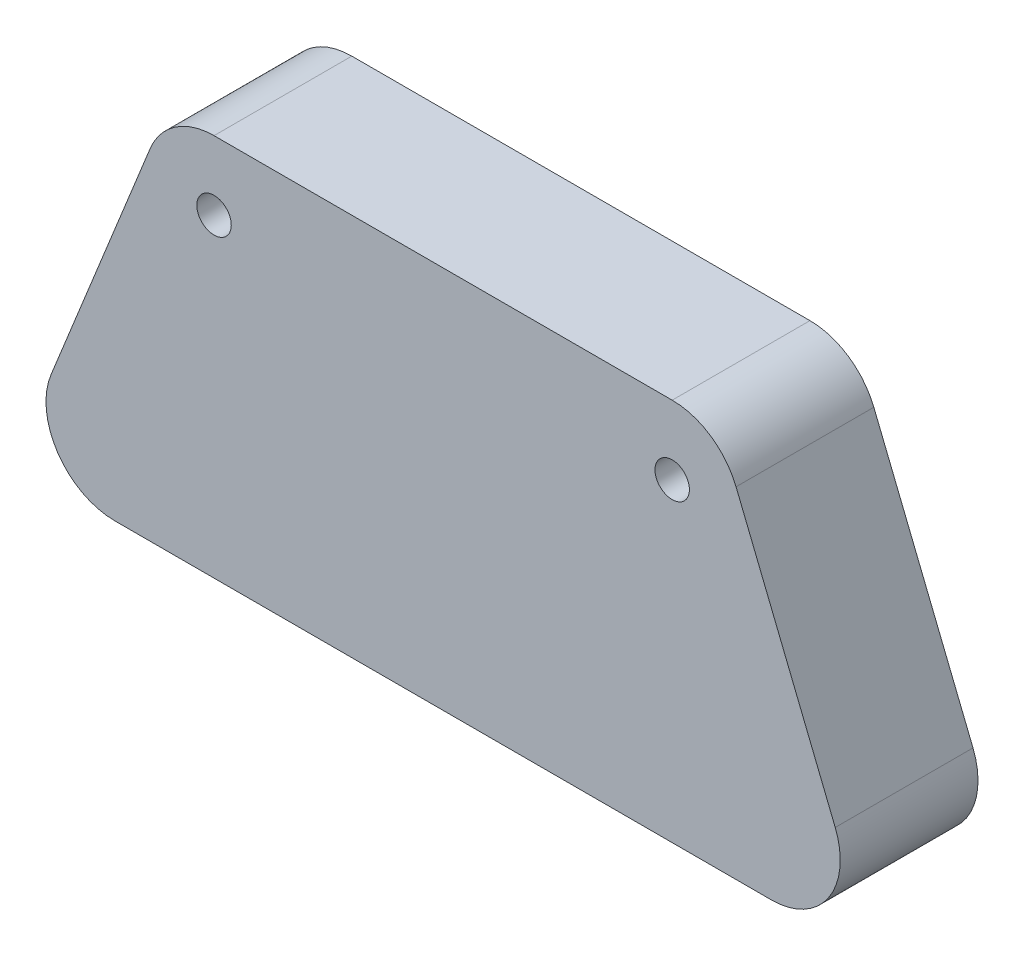
ISO-10303-21;
HEADER;
FILE_DESCRIPTION(('STEP AP214'),'2;1');
FILE_NAME('part.step','',(''),(''),'','','');
FILE_SCHEMA(('AUTOMOTIVE_DESIGN { 1 0 10303 214 1 1 1 1 }'));
ENDSEC;
DATA;
#1=APPLICATION_CONTEXT('core data for automotive mechanical design processes');
#2=APPLICATION_PROTOCOL_DEFINITION('international standard','automotive_design',2000,#1);
#3=PRODUCT_CONTEXT('',#1,'mechanical');
#4=PRODUCT('Part','Part','',(#3));
#5=PRODUCT_RELATED_PRODUCT_CATEGORY('part','',(#4));
#6=PRODUCT_DEFINITION_FORMATION('','',#4);
#7=PRODUCT_DEFINITION_CONTEXT('part definition',#1,'design');
#8=PRODUCT_DEFINITION('design','',#6,#7);
#9=PRODUCT_DEFINITION_SHAPE('','',#8);
#10=(LENGTH_UNIT() NAMED_UNIT(*) SI_UNIT(.MILLI.,.METRE.));
#11=(NAMED_UNIT(*) PLANE_ANGLE_UNIT() SI_UNIT($,.RADIAN.));
#12=(NAMED_UNIT(*) SI_UNIT($,.STERADIAN.) SOLID_ANGLE_UNIT());
#13=UNCERTAINTY_MEASURE_WITH_UNIT(LENGTH_MEASURE(1.E-05),#10,'distance_accuracy_value','');
#14=(GEOMETRIC_REPRESENTATION_CONTEXT(3) GLOBAL_UNCERTAINTY_ASSIGNED_CONTEXT((#13)) GLOBAL_UNIT_ASSIGNED_CONTEXT((#10,
#11,#12)) REPRESENTATION_CONTEXT('',''));
#15=CARTESIAN_POINT('',(0.,0.,0.));
#16=DIRECTION('',(0.,0.,1.));
#17=DIRECTION('',(1.,0.,0.));
#18=AXIS2_PLACEMENT_3D('',#15,#16,#17);
#19=CARTESIAN_POINT('',(-16.0060225330843,-10.1946223443207,10.));
#20=DIRECTION('',(0.,0.,1.));
#21=DIRECTION('',(1.,0.,0.));
#22=AXIS2_PLACEMENT_3D('',#19,#20,#21);
#23=PLANE('',#22);
#24=CARTESIAN_POINT('',(-8.80808698895859,7.62089329268293,10.));
#25=DIRECTION('',(0.,0.,1.));
#26=DIRECTION('',(1.,0.,0.));
#27=AXIS2_PLACEMENT_3D('',#24,#25,#26);
#28=CIRCLE('',#27,1.25);
#29=CARTESIAN_POINT('',(-7.55808698895859,7.62089329268293,10.));
#30=VERTEX_POINT('',#29);
#31=EDGE_CURVE('E133',#30,#30,#28,.T.);
#32=ORIENTED_EDGE('',*,*,#31,.F.);
#33=EDGE_LOOP('',(#32));
#34=FACE_BOUND('',#33,.T.);
#35=CARTESIAN_POINT('',(-16.0060225330843,-10.1946223443207,10.));
#36=DIRECTION('',(0.,0.,1.));
#37=DIRECTION('',(1.,0.,0.));
#38=AXIS2_PLACEMENT_3D('',#35,#36,#37);
#39=CIRCLE('',#38,5.);
#40=CARTESIAN_POINT('',(-20.6419418059183,-8.32158937724111,10.));
#41=VERTEX_POINT('',#40);
#42=CARTESIAN_POINT('',(-16.0060225330843,-15.1946223443207,10.));
#43=VERTEX_POINT('',#42);
#44=EDGE_CURVE('E144',#41,#43,#39,.T.);
#45=ORIENTED_EDGE('',*,*,#44,.T.);
#46=DIRECTION('',(1.,0.,0.));
#47=VECTOR('',#46,1.);
#48=CARTESIAN_POINT('',(-16.0060225330843,-15.1946223443207,10.));
#49=LINE('',#48,#47);
#50=CARTESIAN_POINT('',(31.6447633867428,-15.1946223443207,10.));
#51=VERTEX_POINT('',#50);
#52=EDGE_CURVE('E92',#43,#51,#49,.T.);
#53=ORIENTED_EDGE('',*,*,#52,.T.);
#54=CARTESIAN_POINT('',(31.6447633867429,-10.1946223443207,10.));
#55=DIRECTION('',(0.,0.,1.));
#56=DIRECTION('',(-1.,0.,0.));
#57=AXIS2_PLACEMENT_3D('',#54,#55,#56);
#58=CIRCLE('',#57,5.);
#59=CARTESIAN_POINT('',(36.2806826595768,-8.32158937724112,10.));
#60=VERTEX_POINT('',#59);
#61=EDGE_CURVE('E159',#51,#60,#58,.T.);
#62=ORIENTED_EDGE('',*,*,#61,.T.);
#63=DIRECTION('',(-0.37460659341591,0.927183854566788,0.));
#64=VECTOR('',#63,1.);
#65=CARTESIAN_POINT('',(29.0827471154511,9.49392625976246,10.));
#66=LINE('',#65,#64);
#67=CARTESIAN_POINT('',(29.0827471154511,9.49392625976246,10.));
#68=VERTEX_POINT('',#67);
#69=EDGE_CURVE('E172',#60,#68,#66,.T.);
#70=ORIENTED_EDGE('',*,*,#69,.T.);
#71=CARTESIAN_POINT('',(24.4468278426171,7.62089329268293,10.));
#72=DIRECTION('',(0.,0.,1.));
#73=DIRECTION('',(-1.,0.,0.));
#74=AXIS2_PLACEMENT_3D('',#71,#72,#73);
#75=CIRCLE('',#74,5.);
#76=CARTESIAN_POINT('',(24.4468278426171,12.6208932926829,10.));
#77=VERTEX_POINT('',#76);
#78=EDGE_CURVE('E111',#68,#77,#75,.T.);
#79=ORIENTED_EDGE('',*,*,#78,.T.);
#80=DIRECTION('',(-1.,0.,0.));
#81=VECTOR('',#80,1.);
#82=CARTESIAN_POINT('',(-8.80808698895856,12.6208932926829,10.));
#83=LINE('',#82,#81);
#84=CARTESIAN_POINT('',(-8.80808698895856,12.6208932926829,10.));
#85=VERTEX_POINT('',#84);
#86=EDGE_CURVE('E105',#77,#85,#83,.T.);
#87=ORIENTED_EDGE('',*,*,#86,.T.);
#88=CARTESIAN_POINT('',(-8.80808698895859,7.62089329268293,10.));
#89=DIRECTION('',(0.,0.,1.));
#90=DIRECTION('',(1.,0.,0.));
#91=AXIS2_PLACEMENT_3D('',#88,#89,#90);
#92=CIRCLE('',#91,5.);
#93=CARTESIAN_POINT('',(-13.4440062617925,9.49392625976245,10.));
#94=VERTEX_POINT('',#93);
#95=EDGE_CURVE('E109',#85,#94,#92,.T.);
#96=ORIENTED_EDGE('',*,*,#95,.T.);
#97=DIRECTION('',(-0.37460659341591,-0.927183854566789,0.));
#98=VECTOR('',#97,1.);
#99=CARTESIAN_POINT('',(-13.4440062617925,9.49392625976245,10.));
#100=LINE('',#99,#98);
#101=EDGE_CURVE('E49',#94,#41,#100,.T.);
#102=ORIENTED_EDGE('',*,*,#101,.T.);
#103=EDGE_LOOP('',(#45,#53,#62,#70,#79,#87,#96,#102));
#104=FACE_BOUND('',#103,.T.);
#105=CARTESIAN_POINT('',(24.4468278426171,7.62089329268293,10.));
#106=DIRECTION('',(0.,0.,1.));
#107=DIRECTION('',(1.,0.,0.));
#108=AXIS2_PLACEMENT_3D('',#105,#106,#107);
#109=CIRCLE('',#108,1.25);
#110=CARTESIAN_POINT('',(25.6968278426171,7.62089329268293,10.));
#111=VERTEX_POINT('',#110);
#112=EDGE_CURVE('E181',#111,#111,#109,.T.);
#113=ORIENTED_EDGE('',*,*,#112,.F.);
#114=EDGE_LOOP('',(#113));
#115=FACE_BOUND('',#114,.T.);
#116=ADVANCED_FACE('F32',(#34,#104,#115),#23,.T.);
#117=CARTESIAN_POINT('',(-16.0060225330843,-10.1946223443207,0.));
#118=DIRECTION('',(0.,0.,1.));
#119=DIRECTION('',(1.,0.,0.));
#120=AXIS2_PLACEMENT_3D('',#117,#118,#119);
#121=PLANE('',#120);
#122=CARTESIAN_POINT('',(-8.80808698895859,7.62089329268293,0.));
#123=DIRECTION('',(0.,0.,1.));
#124=DIRECTION('',(1.,0.,0.));
#125=AXIS2_PLACEMENT_3D('',#122,#123,#124);
#126=CIRCLE('',#125,1.25);
#127=CARTESIAN_POINT('',(-7.55808698895859,7.62089329268293,0.));
#128=VERTEX_POINT('',#127);
#129=EDGE_CURVE('E178',#128,#128,#126,.T.);
#130=ORIENTED_EDGE('',*,*,#129,.T.);
#131=EDGE_LOOP('',(#130));
#132=FACE_BOUND('',#131,.T.);
#133=CARTESIAN_POINT('',(-16.0060225330843,-10.1946223443207,0.));
#134=DIRECTION('',(0.,0.,1.));
#135=DIRECTION('',(1.,0.,0.));
#136=AXIS2_PLACEMENT_3D('',#133,#134,#135);
#137=CIRCLE('',#136,5.);
#138=CARTESIAN_POINT('',(-20.6419418059183,-8.32158937724111,0.));
#139=VERTEX_POINT('',#138);
#140=CARTESIAN_POINT('',(-16.0060225330843,-15.1946223443207,0.));
#141=VERTEX_POINT('',#140);
#142=EDGE_CURVE('E129',#139,#141,#137,.T.);
#143=ORIENTED_EDGE('',*,*,#142,.F.);
#144=DIRECTION('',(-0.37460659341591,-0.927183854566789,0.));
#145=VECTOR('',#144,1.);
#146=CARTESIAN_POINT('',(-13.4440062617925,9.49392625976245,0.));
#147=LINE('',#146,#145);
#148=CARTESIAN_POINT('',(-13.4440062617925,9.49392625976245,0.));
#149=VERTEX_POINT('',#148);
#150=EDGE_CURVE('E84',#149,#139,#147,.T.);
#151=ORIENTED_EDGE('',*,*,#150,.F.);
#152=CARTESIAN_POINT('',(-8.80808698895859,7.62089329268293,0.));
#153=DIRECTION('',(0.,0.,1.));
#154=DIRECTION('',(1.,0.,0.));
#155=AXIS2_PLACEMENT_3D('',#152,#153,#154);
#156=CIRCLE('',#155,5.);
#157=CARTESIAN_POINT('',(-8.80808698895856,12.6208932926829,0.));
#158=VERTEX_POINT('',#157);
#159=EDGE_CURVE('E78',#158,#149,#156,.T.);
#160=ORIENTED_EDGE('',*,*,#159,.F.);
#161=DIRECTION('',(-1.,0.,0.));
#162=VECTOR('',#161,1.);
#163=CARTESIAN_POINT('',(-8.80808698895856,12.6208932926829,0.));
#164=LINE('',#163,#162);
#165=CARTESIAN_POINT('',(24.4468278426171,12.6208932926829,0.));
#166=VERTEX_POINT('',#165);
#167=EDGE_CURVE('E119',#166,#158,#164,.T.);
#168=ORIENTED_EDGE('',*,*,#167,.F.);
#169=CARTESIAN_POINT('',(24.4468278426171,7.62089329268293,0.));
#170=DIRECTION('',(0.,0.,1.));
#171=DIRECTION('',(-1.,0.,0.));
#172=AXIS2_PLACEMENT_3D('',#169,#170,#171);
#173=CIRCLE('',#172,5.);
#174=CARTESIAN_POINT('',(29.0827471154511,9.49392625976246,0.));
#175=VERTEX_POINT('',#174);
#176=EDGE_CURVE('E139',#175,#166,#173,.T.);
#177=ORIENTED_EDGE('',*,*,#176,.F.);
#178=DIRECTION('',(-0.37460659341591,0.927183854566788,0.));
#179=VECTOR('',#178,1.);
#180=CARTESIAN_POINT('',(29.0827471154511,9.49392625976246,0.));
#181=LINE('',#180,#179);
#182=CARTESIAN_POINT('',(36.2806826595768,-8.32158937724112,0.));
#183=VERTEX_POINT('',#182);
#184=EDGE_CURVE('E137',#183,#175,#181,.T.);
#185=ORIENTED_EDGE('',*,*,#184,.F.);
#186=CARTESIAN_POINT('',(31.6447633867429,-10.1946223443207,0.));
#187=DIRECTION('',(0.,0.,1.));
#188=DIRECTION('',(-1.,0.,0.));
#189=AXIS2_PLACEMENT_3D('',#186,#187,#188);
#190=CIRCLE('',#189,5.);
#191=CARTESIAN_POINT('',(31.6447633867428,-15.1946223443207,0.));
#192=VERTEX_POINT('',#191);
#193=EDGE_CURVE('E135',#192,#183,#190,.T.);
#194=ORIENTED_EDGE('',*,*,#193,.F.);
#195=DIRECTION('',(1.,0.,0.));
#196=VECTOR('',#195,1.);
#197=CARTESIAN_POINT('',(-16.0060225330843,-15.1946223443207,0.));
#198=LINE('',#197,#196);
#199=EDGE_CURVE('E132',#141,#192,#198,.T.);
#200=ORIENTED_EDGE('',*,*,#199,.F.);
#201=EDGE_LOOP('',(#143,#151,#160,#168,#177,#185,#194,#200));
#202=FACE_BOUND('',#201,.T.);
#203=CARTESIAN_POINT('',(24.4468278426171,7.62089329268293,0.));
#204=DIRECTION('',(0.,0.,1.));
#205=DIRECTION('',(1.,0.,0.));
#206=AXIS2_PLACEMENT_3D('',#203,#204,#205);
#207=CIRCLE('',#206,1.25);
#208=CARTESIAN_POINT('',(25.6968278426171,7.62089329268293,0.));
#209=VERTEX_POINT('',#208);
#210=EDGE_CURVE('E184',#209,#209,#207,.T.);
#211=ORIENTED_EDGE('',*,*,#210,.T.);
#212=EDGE_LOOP('',(#211));
#213=FACE_BOUND('',#212,.T.);
#214=ADVANCED_FACE('F163',(#132,#202,#213),#121,.F.);
#215=CARTESIAN_POINT('',(-16.0060225330843,-10.1946223443207,10.));
#216=DIRECTION('',(0.,0.,-1.));
#217=DIRECTION('',(-1.,0.,0.));
#218=AXIS2_PLACEMENT_3D('',#215,#216,#217);
#219=CYLINDRICAL_SURFACE('',#218,5.);
#220=ORIENTED_EDGE('',*,*,#142,.T.);
#221=DIRECTION('',(0.,0.,-1.));
#222=VECTOR('',#221,1.);
#223=CARTESIAN_POINT('',(-16.0060225330843,-15.1946223443207,10.));
#224=LINE('',#223,#222);
#225=EDGE_CURVE('E11',#43,#141,#224,.T.);
#226=ORIENTED_EDGE('',*,*,#225,.F.);
#227=ORIENTED_EDGE('',*,*,#44,.F.);
#228=DIRECTION('',(0.,0.,-1.));
#229=VECTOR('',#228,1.);
#230=CARTESIAN_POINT('',(-20.6419418059183,-8.32158937724111,10.));
#231=LINE('',#230,#229);
#232=EDGE_CURVE('E125',#41,#139,#231,.T.);
#233=ORIENTED_EDGE('',*,*,#232,.T.);
#234=EDGE_LOOP('',(#220,#226,#227,#233));
#235=FACE_BOUND('',#234,.T.);
#236=ADVANCED_FACE('F34',(#235),#219,.T.);
#237=CARTESIAN_POINT('',(-16.0060225330843,-15.1946223443207,10.));
#238=DIRECTION('',(0.,1.,0.));
#239=DIRECTION('',(-1.,0.,0.));
#240=AXIS2_PLACEMENT_3D('',#237,#238,#239);
#241=PLANE('',#240);
#242=ORIENTED_EDGE('',*,*,#199,.T.);
#243=DIRECTION('',(0.,0.,-1.));
#244=VECTOR('',#243,1.);
#245=CARTESIAN_POINT('',(31.6447633867428,-15.1946223443207,10.));
#246=LINE('',#245,#244);
#247=EDGE_CURVE('E41',#51,#192,#246,.T.);
#248=ORIENTED_EDGE('',*,*,#247,.F.);
#249=ORIENTED_EDGE('',*,*,#52,.F.);
#250=ORIENTED_EDGE('',*,*,#225,.T.);
#251=EDGE_LOOP('',(#242,#248,#249,#250));
#252=FACE_BOUND('',#251,.T.);
#253=ADVANCED_FACE('F217',(#252),#241,.F.);
#254=CARTESIAN_POINT('',(31.6447633867429,-10.1946223443207,10.));
#255=DIRECTION('',(0.,0.,-1.));
#256=DIRECTION('',(-1.,0.,0.));
#257=AXIS2_PLACEMENT_3D('',#254,#255,#256);
#258=CYLINDRICAL_SURFACE('',#257,5.);
#259=ORIENTED_EDGE('',*,*,#193,.T.);
#260=DIRECTION('',(0.,0.,-1.));
#261=VECTOR('',#260,1.);
#262=CARTESIAN_POINT('',(36.2806826595768,-8.32158937724112,10.));
#263=LINE('',#262,#261);
#264=EDGE_CURVE('E151',#60,#183,#263,.T.);
#265=ORIENTED_EDGE('',*,*,#264,.F.);
#266=ORIENTED_EDGE('',*,*,#61,.F.);
#267=ORIENTED_EDGE('',*,*,#247,.T.);
#268=EDGE_LOOP('',(#259,#265,#266,#267));
#269=FACE_BOUND('',#268,.T.);
#270=ADVANCED_FACE('F157',(#269),#258,.T.);
#271=CARTESIAN_POINT('',(29.0827471154511,9.49392625976246,10.));
#272=DIRECTION('',(-0.927183854566789,-0.37460659341591,0.));
#273=DIRECTION('',(0.37460659341591,-0.927183854566789,0.));
#274=AXIS2_PLACEMENT_3D('',#271,#272,#273);
#275=PLANE('',#274);
#276=ORIENTED_EDGE('',*,*,#184,.T.);
#277=DIRECTION('',(0.,0.,-1.));
#278=VECTOR('',#277,1.);
#279=CARTESIAN_POINT('',(29.0827471154511,9.49392625976246,10.));
#280=LINE('',#279,#278);
#281=EDGE_CURVE('E148',#68,#175,#280,.T.);
#282=ORIENTED_EDGE('',*,*,#281,.F.);
#283=ORIENTED_EDGE('',*,*,#69,.F.);
#284=ORIENTED_EDGE('',*,*,#264,.T.);
#285=EDGE_LOOP('',(#276,#282,#283,#284));
#286=FACE_BOUND('',#285,.T.);
#287=ADVANCED_FACE('F168',(#286),#275,.F.);
#288=CARTESIAN_POINT('',(24.4468278426171,7.62089329268293,10.));
#289=DIRECTION('',(0.,0.,-1.));
#290=DIRECTION('',(-1.,0.,0.));
#291=AXIS2_PLACEMENT_3D('',#288,#289,#290);
#292=CYLINDRICAL_SURFACE('',#291,5.);
#293=ORIENTED_EDGE('',*,*,#176,.T.);
#294=DIRECTION('',(0.,0.,-1.));
#295=VECTOR('',#294,1.);
#296=CARTESIAN_POINT('',(24.4468278426171,12.6208932926829,10.));
#297=LINE('',#296,#295);
#298=EDGE_CURVE('E120',#77,#166,#297,.T.);
#299=ORIENTED_EDGE('',*,*,#298,.F.);
#300=ORIENTED_EDGE('',*,*,#78,.F.);
#301=ORIENTED_EDGE('',*,*,#281,.T.);
#302=EDGE_LOOP('',(#293,#299,#300,#301));
#303=FACE_BOUND('',#302,.T.);
#304=ADVANCED_FACE('F171',(#303),#292,.T.);
#305=CARTESIAN_POINT('',(-8.80808698895856,12.6208932926829,10.));
#306=DIRECTION('',(0.,-1.,0.));
#307=DIRECTION('',(1.,0.,0.));
#308=AXIS2_PLACEMENT_3D('',#305,#306,#307);
#309=PLANE('',#308);
#310=ORIENTED_EDGE('',*,*,#167,.T.);
#311=DIRECTION('',(0.,0.,-1.));
#312=VECTOR('',#311,1.);
#313=CARTESIAN_POINT('',(-8.80808698895856,12.6208932926829,10.));
#314=LINE('',#313,#312);
#315=EDGE_CURVE('E116',#85,#158,#314,.T.);
#316=ORIENTED_EDGE('',*,*,#315,.F.);
#317=ORIENTED_EDGE('',*,*,#86,.F.);
#318=ORIENTED_EDGE('',*,*,#298,.T.);
#319=EDGE_LOOP('',(#310,#316,#317,#318));
#320=FACE_BOUND('',#319,.T.);
#321=ADVANCED_FACE('F117',(#320),#309,.F.);
#322=CARTESIAN_POINT('',(-8.80808698895859,7.62089329268293,10.));
#323=DIRECTION('',(0.,0.,-1.));
#324=DIRECTION('',(-1.,0.,0.));
#325=AXIS2_PLACEMENT_3D('',#322,#323,#324);
#326=CYLINDRICAL_SURFACE('',#325,5.);
#327=ORIENTED_EDGE('',*,*,#159,.T.);
#328=DIRECTION('',(0.,0.,-1.));
#329=VECTOR('',#328,1.);
#330=CARTESIAN_POINT('',(-13.4440062617925,9.49392625976245,10.));
#331=LINE('',#330,#329);
#332=EDGE_CURVE('E121',#94,#149,#331,.T.);
#333=ORIENTED_EDGE('',*,*,#332,.F.);
#334=ORIENTED_EDGE('',*,*,#95,.F.);
#335=ORIENTED_EDGE('',*,*,#315,.T.);
#336=EDGE_LOOP('',(#327,#333,#334,#335));
#337=FACE_BOUND('',#336,.T.);
#338=ADVANCED_FACE('F123',(#337),#326,.T.);
#339=CARTESIAN_POINT('',(-13.4440062617925,9.49392625976245,10.));
#340=DIRECTION('',(0.927183854566788,-0.37460659341591,0.));
#341=DIRECTION('',(0.37460659341591,0.927183854566788,0.));
#342=AXIS2_PLACEMENT_3D('',#339,#340,#341);
#343=PLANE('',#342);
#344=ORIENTED_EDGE('',*,*,#150,.T.);
#345=ORIENTED_EDGE('',*,*,#232,.F.);
#346=ORIENTED_EDGE('',*,*,#101,.F.);
#347=ORIENTED_EDGE('',*,*,#332,.T.);
#348=EDGE_LOOP('',(#344,#345,#346,#347));
#349=FACE_BOUND('',#348,.T.);
#350=ADVANCED_FACE('F205',(#349),#343,.F.);
#351=CARTESIAN_POINT('',(-8.80808698895859,7.62089329268293,10.));
#352=DIRECTION('',(0.,0.,-1.));
#353=DIRECTION('',(-1.,0.,0.));
#354=AXIS2_PLACEMENT_3D('',#351,#352,#353);
#355=CYLINDRICAL_SURFACE('',#354,1.25);
#356=ORIENTED_EDGE('',*,*,#31,.T.);
#357=EDGE_LOOP('',(#356));
#358=FACE_BOUND('',#357,.T.);
#359=ORIENTED_EDGE('',*,*,#129,.F.);
#360=EDGE_LOOP('',(#359));
#361=FACE_BOUND('',#360,.T.);
#362=ADVANCED_FACE('F202',(#358,#361),#355,.F.);
#363=CARTESIAN_POINT('',(24.4468278426171,7.62089329268293,10.));
#364=DIRECTION('',(0.,0.,-1.));
#365=DIRECTION('',(-1.,0.,0.));
#366=AXIS2_PLACEMENT_3D('',#363,#364,#365);
#367=CYLINDRICAL_SURFACE('',#366,1.25);
#368=ORIENTED_EDGE('',*,*,#112,.T.);
#369=EDGE_LOOP('',(#368));
#370=FACE_BOUND('',#369,.T.);
#371=ORIENTED_EDGE('',*,*,#210,.F.);
#372=EDGE_LOOP('',(#371));
#373=FACE_BOUND('',#372,.T.);
#374=ADVANCED_FACE('F190',(#370,#373),#367,.F.);
#375=CLOSED_SHELL('',(#116,#214,#236,#253,#270,#287,#304,#321,#338,#350,#362,#374));
#376=MANIFOLD_SOLID_BREP('B2',#375);
#377=ADVANCED_BREP_SHAPE_REPRESENTATION('',(#18,#376),#14);
#378=SHAPE_DEFINITION_REPRESENTATION(#9,#377);
ENDSEC;
END-ISO-10303-21;
